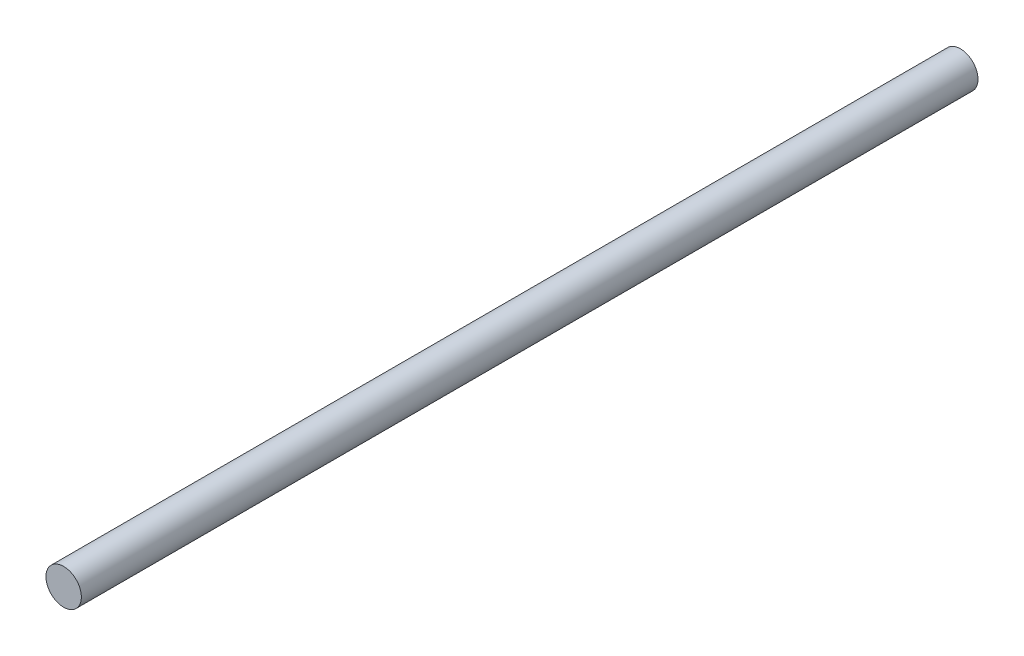
ISO-10303-21;
HEADER;
FILE_DESCRIPTION(('STEP AP214'),'2;1');
FILE_NAME('part.step','',(''),(''),'','','');
FILE_SCHEMA(('AUTOMOTIVE_DESIGN { 1 0 10303 214 1 1 1 1 }'));
ENDSEC;
DATA;
#1=APPLICATION_CONTEXT('core data for automotive mechanical design processes');
#2=APPLICATION_PROTOCOL_DEFINITION('international standard','automotive_design',2000,#1);
#3=PRODUCT_CONTEXT('',#1,'mechanical');
#4=PRODUCT('Part','Part','',(#3));
#5=PRODUCT_RELATED_PRODUCT_CATEGORY('part','',(#4));
#6=PRODUCT_DEFINITION_FORMATION('','',#4);
#7=PRODUCT_DEFINITION_CONTEXT('part definition',#1,'design');
#8=PRODUCT_DEFINITION('design','',#6,#7);
#9=PRODUCT_DEFINITION_SHAPE('','',#8);
#10=(LENGTH_UNIT() NAMED_UNIT(*) SI_UNIT(.MILLI.,.METRE.));
#11=(NAMED_UNIT(*) PLANE_ANGLE_UNIT() SI_UNIT($,.RADIAN.));
#12=(NAMED_UNIT(*) SI_UNIT($,.STERADIAN.) SOLID_ANGLE_UNIT());
#13=UNCERTAINTY_MEASURE_WITH_UNIT(LENGTH_MEASURE(1.E-05),#10,'distance_accuracy_value','');
#14=(GEOMETRIC_REPRESENTATION_CONTEXT(3) GLOBAL_UNCERTAINTY_ASSIGNED_CONTEXT((#13)) GLOBAL_UNIT_ASSIGNED_CONTEXT((#10,
#11,#12)) REPRESENTATION_CONTEXT('',''));
#15=CARTESIAN_POINT('',(0.,0.,0.));
#16=DIRECTION('',(0.,0.,1.));
#17=DIRECTION('',(1.,0.,0.));
#18=AXIS2_PLACEMENT_3D('',#15,#16,#17);
#19=CARTESIAN_POINT('',(0.,0.,241.3));
#20=DIRECTION('',(0.,0.,-1.));
#21=DIRECTION('',(-1.,0.,0.));
#22=AXIS2_PLACEMENT_3D('',#19,#20,#21);
#23=CYLINDRICAL_SURFACE('',#22,4.7625);
#24=CARTESIAN_POINT('',(0.,0.,241.3));
#25=DIRECTION('',(0.,0.,1.));
#26=DIRECTION('',(1.,0.,0.));
#27=AXIS2_PLACEMENT_3D('',#24,#25,#26);
#28=CIRCLE('',#27,4.7625);
#29=CARTESIAN_POINT('',(4.7625,0.,241.3));
#30=VERTEX_POINT('',#29);
#31=EDGE_CURVE('E10',#30,#30,#28,.T.);
#32=ORIENTED_EDGE('',*,*,#31,.F.);
#33=EDGE_LOOP('',(#32));
#34=FACE_BOUND('',#33,.T.);
#35=CARTESIAN_POINT('',(0.,0.,0.));
#36=DIRECTION('',(0.,0.,1.));
#37=DIRECTION('',(1.,0.,0.));
#38=AXIS2_PLACEMENT_3D('',#35,#36,#37);
#39=CIRCLE('',#38,4.7625);
#40=CARTESIAN_POINT('',(4.7625,0.,0.));
#41=VERTEX_POINT('',#40);
#42=EDGE_CURVE('E32',#41,#41,#39,.T.);
#43=ORIENTED_EDGE('',*,*,#42,.T.);
#44=EDGE_LOOP('',(#43));
#45=FACE_BOUND('',#44,.T.);
#46=ADVANCED_FACE('F29',(#34,#45),#23,.T.);
#47=CARTESIAN_POINT('',(0.,0.,241.3));
#48=DIRECTION('',(0.,0.,1.));
#49=DIRECTION('',(1.,0.,0.));
#50=AXIS2_PLACEMENT_3D('',#47,#48,#49);
#51=PLANE('',#50);
#52=ORIENTED_EDGE('',*,*,#31,.T.);
#53=EDGE_LOOP('',(#52));
#54=FACE_BOUND('',#53,.T.);
#55=ADVANCED_FACE('F44',(#54),#51,.T.);
#56=CARTESIAN_POINT('',(0.,0.,0.));
#57=DIRECTION('',(0.,0.,1.));
#58=DIRECTION('',(1.,0.,0.));
#59=AXIS2_PLACEMENT_3D('',#56,#57,#58);
#60=PLANE('',#59);
#61=ORIENTED_EDGE('',*,*,#42,.F.);
#62=EDGE_LOOP('',(#61));
#63=FACE_BOUND('',#62,.T.);
#64=ADVANCED_FACE('F42',(#63),#60,.F.);
#65=CLOSED_SHELL('',(#46,#55,#64));
#66=MANIFOLD_SOLID_BREP('B2',#65);
#67=ADVANCED_BREP_SHAPE_REPRESENTATION('',(#18,#66),#14);
#68=SHAPE_DEFINITION_REPRESENTATION(#9,#67);
ENDSEC;
END-ISO-10303-21;
